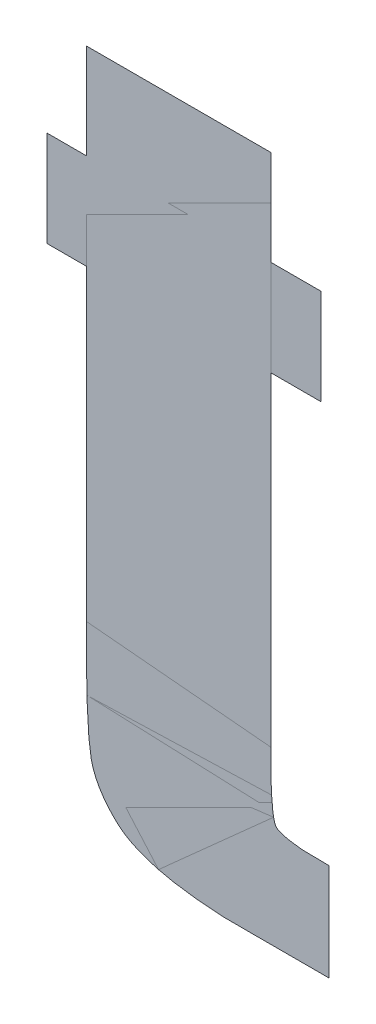
ISO-10303-21;
HEADER;
FILE_DESCRIPTION(('STEP AP214'),'2;1');
FILE_NAME('part.step','',(''),(''),'','','');
FILE_SCHEMA(('AUTOMOTIVE_DESIGN { 1 0 10303 214 1 1 1 1 }'));
ENDSEC;
DATA;
#1=APPLICATION_CONTEXT('core data for automotive mechanical design processes');
#2=APPLICATION_PROTOCOL_DEFINITION('international standard','automotive_design',2000,#1);
#3=PRODUCT_CONTEXT('',#1,'mechanical');
#4=PRODUCT('Part','Part','',(#3));
#5=PRODUCT_RELATED_PRODUCT_CATEGORY('part','',(#4));
#6=PRODUCT_DEFINITION_FORMATION('','',#4);
#7=PRODUCT_DEFINITION_CONTEXT('part definition',#1,'design');
#8=PRODUCT_DEFINITION('design','',#6,#7);
#9=PRODUCT_DEFINITION_SHAPE('','',#8);
#10=(LENGTH_UNIT() NAMED_UNIT(*) SI_UNIT(.MILLI.,.METRE.));
#11=(NAMED_UNIT(*) PLANE_ANGLE_UNIT() SI_UNIT($,.RADIAN.));
#12=(NAMED_UNIT(*) SI_UNIT($,.STERADIAN.) SOLID_ANGLE_UNIT());
#13=UNCERTAINTY_MEASURE_WITH_UNIT(LENGTH_MEASURE(1.E-05),#10,'distance_accuracy_value','');
#14=(GEOMETRIC_REPRESENTATION_CONTEXT(3) GLOBAL_UNCERTAINTY_ASSIGNED_CONTEXT((#13)) GLOBAL_UNIT_ASSIGNED_CONTEXT((#10,
#11,#12)) REPRESENTATION_CONTEXT('',''));
#15=CARTESIAN_POINT('',(0.,0.,0.));
#16=DIRECTION('',(0.,0.,1.));
#17=DIRECTION('',(1.,0.,0.));
#18=AXIS2_PLACEMENT_3D('',#15,#16,#17);
#19=CARTESIAN_POINT('',(6.282653354239,0.801967895412,0.001668));
#20=DIRECTION('',(0.,0.,1.));
#21=DIRECTION('',(1.,0.,0.));
#22=AXIS2_PLACEMENT_3D('',#19,#20,#21);
#23=PLANE('',#22);
#24=CARTESIAN_POINT('',(6.321359234797,0.840089908038,0.001668));
#25=DIRECTION('',(0.,1.,0.));
#26=VECTOR('',#25,1.);
#27=LINE('',#24,#26);
#28=CARTESIAN_POINT('',(6.321359234797,0.840089908038,0.0015));
#29=VERTEX_POINT('',#28);
#30=CARTESIAN_POINT('',(6.321359234797,0.869123819549,0.0015));
#31=VERTEX_POINT('',#30);
#32=EDGE_CURVE('E215',#29,#31,#27,.T.);
#33=ORIENTED_EDGE('',*,*,#32,.T.);
#34=CARTESIAN_POINT('',(6.321359234797,0.869123819549,0.001668));
#35=DIRECTION('',(-1.,0.,0.));
#36=VECTOR('',#35,1.);
#37=LINE('',#34,#36);
#38=CARTESIAN_POINT('',(6.306167071797,0.869123819549,0.0015));
#39=VERTEX_POINT('',#38);
#40=EDGE_CURVE('E28',#31,#39,#37,.T.);
#41=ORIENTED_EDGE('',*,*,#40,.T.);
#42=CARTESIAN_POINT('',(6.306167071797,0.869123819549,0.001668));
#43=DIRECTION('',(0.,1.,0.));
#44=VECTOR('',#43,1.);
#45=LINE('',#42,#44);
#46=CARTESIAN_POINT('',(6.306167071797,0.897988929248,0.0015));
#47=VERTEX_POINT('',#46);
#48=EDGE_CURVE('E11',#39,#47,#45,.T.);
#49=ORIENTED_EDGE('',*,*,#48,.T.);
#50=CARTESIAN_POINT('',(6.306167071797,0.897988929248,0.001668));
#51=DIRECTION('',(-1.,0.,0.));
#52=VECTOR('',#51,1.);
#53=LINE('',#50,#52);
#54=CARTESIAN_POINT('',(6.25012487051,0.897988929248,0.0015));
#55=VERTEX_POINT('',#54);
#56=EDGE_CURVE('E77',#47,#55,#53,.T.);
#57=ORIENTED_EDGE('',*,*,#56,.T.);
#58=CARTESIAN_POINT('',(6.25012487051,0.897988929248,0.001668));
#59=DIRECTION('',(0.,-1.,0.));
#60=VECTOR('',#59,1.);
#61=LINE('',#58,#60);
#62=CARTESIAN_POINT('',(6.25012487051,0.869123819549,0.0015));
#63=VERTEX_POINT('',#62);
#64=EDGE_CURVE('E74',#55,#63,#61,.T.);
#65=ORIENTED_EDGE('',*,*,#64,.T.);
#66=CARTESIAN_POINT('',(6.25012487051,0.869123819549,0.001668));
#67=DIRECTION('',(-1.,0.,0.));
#68=VECTOR('',#67,1.);
#69=LINE('',#66,#68);
#70=CARTESIAN_POINT('',(6.238139941921,0.869123819549,0.0015));
#71=VERTEX_POINT('',#70);
#72=EDGE_CURVE('E196',#63,#71,#69,.T.);
#73=ORIENTED_EDGE('',*,*,#72,.T.);
#74=CARTESIAN_POINT('',(6.238139941921,0.869123819549,0.001668));
#75=DIRECTION('',(0.,-1.,0.));
#76=VECTOR('',#75,1.);
#77=LINE('',#74,#76);
#78=CARTESIAN_POINT('',(6.238139941921,0.840089908038,0.0015));
#79=VERTEX_POINT('',#78);
#80=EDGE_CURVE('E197',#71,#79,#77,.T.);
#81=ORIENTED_EDGE('',*,*,#80,.T.);
#82=CARTESIAN_POINT('',(6.238139941921,0.840089908038,0.001668));
#83=DIRECTION('',(1.,0.,0.));
#84=VECTOR('',#83,1.);
#85=LINE('',#82,#84);
#86=CARTESIAN_POINT('',(6.25012487051,0.840089908038,0.0015));
#87=VERTEX_POINT('',#86);
#88=EDGE_CURVE('E198',#79,#87,#85,.T.);
#89=ORIENTED_EDGE('',*,*,#88,.T.);
#90=CARTESIAN_POINT('',(6.25012487051,0.840089908038,0.001668));
#91=DIRECTION('',(0.,-1.,0.));
#92=VECTOR('',#91,1.);
#93=LINE('',#90,#92);
#94=CARTESIAN_POINT('',(6.25012487051,0.746742506497,0.0015));
#95=VERTEX_POINT('',#94);
#96=EDGE_CURVE('E200',#87,#95,#93,.T.);
#97=ORIENTED_EDGE('',*,*,#96,.T.);
#98=CARTESIAN_POINT('',(6.25012487051,0.746742506497,0.001668));
#99=CARTESIAN_POINT('',(6.25012487051,0.720283110157422,0.001668));
#100=CARTESIAN_POINT('',(6.25164408681,0.7119693334085,0.001668));
#101=CARTESIAN_POINT('',(6.25292438573051,0.704963010874324,0.001668));
#102=CARTESIAN_POINT('',(6.259408970121,0.6988027921425,0.001668));
#103=CARTESIAN_POINT('',(6.26882654289921,0.689856296154,0.001668));
#104=CARTESIAN_POINT('',(6.301103017464,0.689856296154,0.001668));
#105=B_SPLINE_CURVE_WITH_KNOTS('',2,(#98,#99,#100,#101,#102,#103,#104),.UNSPECIFIED.,.F.,.F.,(3,
2,2,3),(0.,0.25,0.5,1.),.UNSPECIFIED.);
#106=CARTESIAN_POINT('',(6.301103017464,0.689856296154,0.0015));
#107=VERTEX_POINT('',#106);
#108=EDGE_CURVE('E202',#95,#107,#105,.T.);
#109=ORIENTED_EDGE('',*,*,#108,.T.);
#110=CARTESIAN_POINT('',(6.301103017464,0.689856296154,0.001668));
#111=DIRECTION('',(1.,0.,0.));
#112=VECTOR('',#111,1.);
#113=LINE('',#110,#112);
#114=CARTESIAN_POINT('',(6.323722460152,0.689856296154,0.0015));
#115=VERTEX_POINT('',#114);
#116=EDGE_CURVE('E204',#107,#115,#113,.T.);
#117=ORIENTED_EDGE('',*,*,#116,.T.);
#118=CARTESIAN_POINT('',(6.323722460152,0.689856296154,0.001668));
#119=DIRECTION('',(0.,1.,0.));
#120=VECTOR('',#119,1.);
#121=LINE('',#118,#120);
#122=CARTESIAN_POINT('',(6.323722460152,0.719396613097,0.0015));
#123=VERTEX_POINT('',#122);
#124=EDGE_CURVE('E206',#115,#123,#121,.T.);
#125=ORIENTED_EDGE('',*,*,#124,.T.);
#126=CARTESIAN_POINT('',(6.323722460152,0.719396613097,0.001668));
#127=CARTESIAN_POINT('',(6.31101434829915,0.719396613097,0.001668));
#128=CARTESIAN_POINT('',(6.3080238917195,0.721506635736,0.001668));
#129=CARTESIAN_POINT('',(6.306167071797,0.722816780848848,0.001668));
#130=CARTESIAN_POINT('',(6.306167071797,0.741678452163,0.001668));
#131=B_SPLINE_CURVE_WITH_KNOTS('',2,(#126,#127,#128,#129,#130),.UNSPECIFIED.,.F.,.F.,(3,2,3),
(0.,0.5,1.),.UNSPECIFIED.);
#132=CARTESIAN_POINT('',(6.306167071797,0.741678452163,0.0015));
#133=VERTEX_POINT('',#132);
#134=EDGE_CURVE('E208',#123,#133,#131,.T.);
#135=ORIENTED_EDGE('',*,*,#134,.T.);
#136=CARTESIAN_POINT('',(6.306167071797,0.741678452163,0.001668));
#137=DIRECTION('',(0.,1.,0.));
#138=VECTOR('',#137,1.);
#139=LINE('',#136,#138);
#140=CARTESIAN_POINT('',(6.306167071797,0.840089908038,0.0015));
#141=VERTEX_POINT('',#140);
#142=EDGE_CURVE('E210',#133,#141,#139,.T.);
#143=ORIENTED_EDGE('',*,*,#142,.T.);
#144=CARTESIAN_POINT('',(6.306167071797,0.840089908038,0.001668));
#145=DIRECTION('',(1.,0.,0.));
#146=VECTOR('',#145,1.);
#147=LINE('',#144,#146);
#148=EDGE_CURVE('E213',#141,#29,#147,.T.);
#149=ORIENTED_EDGE('',*,*,#148,.T.);
#150=EDGE_LOOP('',(#33,#41,#49,#57,#65,#73,#81,#89,#97,#109,#117,#125,#135,#143,#149));
#151=FACE_BOUND('',#150,.T.);
#152=ADVANCED_FACE('F17',(#151),#23,.T.);
#153=CARTESIAN_POINT('',(6.282653354239,0.801967895412,0.001332));
#154=DIRECTION('',(0.,0.,1.));
#155=DIRECTION('',(1.,0.,0.));
#156=AXIS2_PLACEMENT_3D('',#153,#154,#155);
#157=PLANE('',#156);
#158=ORIENTED_EDGE('',*,*,#40,.F.);
#159=ORIENTED_EDGE('',*,*,#32,.F.);
#160=ORIENTED_EDGE('',*,*,#148,.F.);
#161=ORIENTED_EDGE('',*,*,#142,.F.);
#162=ORIENTED_EDGE('',*,*,#134,.F.);
#163=ORIENTED_EDGE('',*,*,#124,.F.);
#164=ORIENTED_EDGE('',*,*,#116,.F.);
#165=ORIENTED_EDGE('',*,*,#108,.F.);
#166=ORIENTED_EDGE('',*,*,#96,.F.);
#167=ORIENTED_EDGE('',*,*,#88,.F.);
#168=ORIENTED_EDGE('',*,*,#80,.F.);
#169=ORIENTED_EDGE('',*,*,#72,.F.);
#170=ORIENTED_EDGE('',*,*,#64,.F.);
#171=ORIENTED_EDGE('',*,*,#56,.F.);
#172=ORIENTED_EDGE('',*,*,#48,.F.);
#173=EDGE_LOOP('',(#158,#159,#160,#161,#162,#163,#164,#165,#166,#167,#168,#169,#170,#171,#172));
#174=FACE_BOUND('',#173,.T.);
#175=ADVANCED_FACE('F79',(#174),#157,.F.);
#176=CLOSED_SHELL('',(#152,#175));
#177=MANIFOLD_SOLID_BREP('B1',#176);
#178=ADVANCED_BREP_SHAPE_REPRESENTATION('',(#18,#177),#14);
#179=SHAPE_DEFINITION_REPRESENTATION(#9,#178);
ENDSEC;
END-ISO-10303-21;
